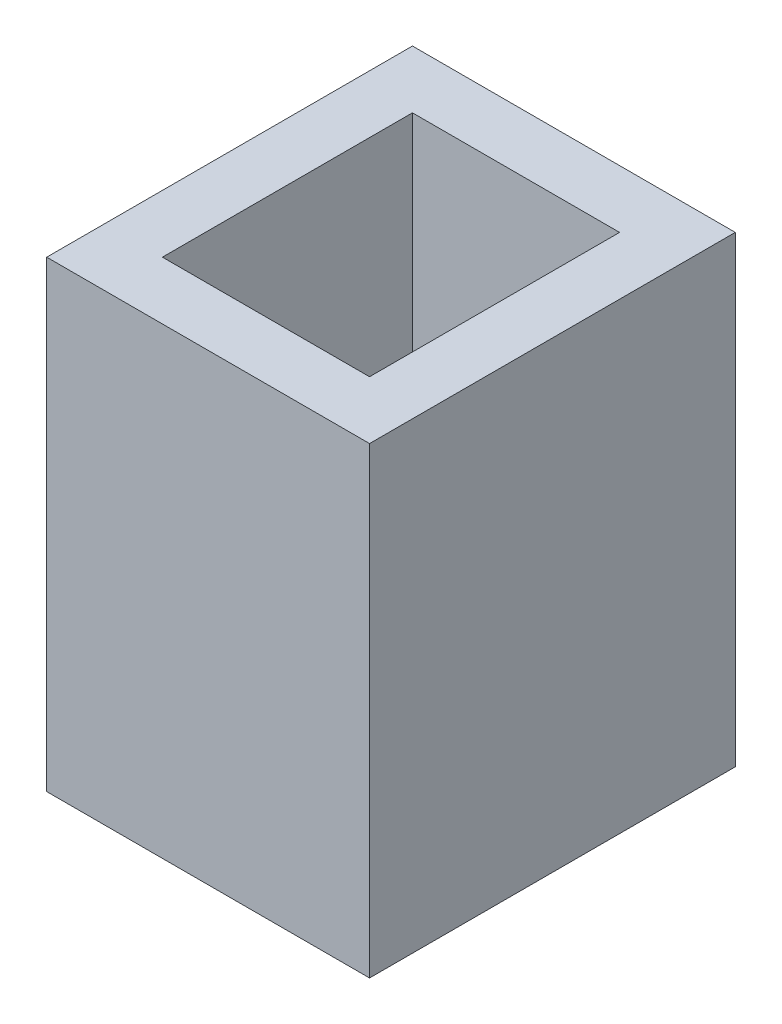
ISO-10303-21;
HEADER;
FILE_DESCRIPTION(('STEP AP214'),'2;1');
FILE_NAME('part.step','',(''),(''),'','','');
FILE_SCHEMA(('AUTOMOTIVE_DESIGN { 1 0 10303 214 1 1 1 1 }'));
ENDSEC;
DATA;
#1=APPLICATION_CONTEXT('core data for automotive mechanical design processes');
#2=APPLICATION_PROTOCOL_DEFINITION('international standard','automotive_design',2000,#1);
#3=PRODUCT_CONTEXT('',#1,'mechanical');
#4=PRODUCT('Part','Part','',(#3));
#5=PRODUCT_RELATED_PRODUCT_CATEGORY('part','',(#4));
#6=PRODUCT_DEFINITION_FORMATION('','',#4);
#7=PRODUCT_DEFINITION_CONTEXT('part definition',#1,'design');
#8=PRODUCT_DEFINITION('design','',#6,#7);
#9=PRODUCT_DEFINITION_SHAPE('','',#8);
#10=(LENGTH_UNIT() NAMED_UNIT(*) SI_UNIT(.MILLI.,.METRE.));
#11=(NAMED_UNIT(*) PLANE_ANGLE_UNIT() SI_UNIT($,.RADIAN.));
#12=(NAMED_UNIT(*) SI_UNIT($,.STERADIAN.) SOLID_ANGLE_UNIT());
#13=UNCERTAINTY_MEASURE_WITH_UNIT(LENGTH_MEASURE(1.E-05),#10,'distance_accuracy_value','');
#14=(GEOMETRIC_REPRESENTATION_CONTEXT(3) GLOBAL_UNCERTAINTY_ASSIGNED_CONTEXT((#13)) GLOBAL_UNIT_ASSIGNED_CONTEXT((#10,
#11,#12)) REPRESENTATION_CONTEXT('',''));
#15=CARTESIAN_POINT('',(0.,0.,0.));
#16=DIRECTION('',(0.,0.,1.));
#17=DIRECTION('',(1.,0.,0.));
#18=AXIS2_PLACEMENT_3D('',#15,#16,#17);
#19=CARTESIAN_POINT('',(0.,25.4,0.));
#20=DIRECTION('',(0.,-1.,0.));
#21=DIRECTION('',(0.,0.,-1.));
#22=AXIS2_PLACEMENT_3D('',#19,#20,#21);
#23=PLANE('',#22);
#24=DIRECTION('',(0.,0.,-1.));
#25=VECTOR('',#24,1.);
#26=CARTESIAN_POINT('',(8.85825,25.4,10.03554));
#27=LINE('',#26,#25);
#28=CARTESIAN_POINT('',(8.85825,25.4,10.03554));
#29=VERTEX_POINT('',#28);
#30=CARTESIAN_POINT('',(8.85825,25.4,-10.03554));
#31=VERTEX_POINT('',#30);
#32=EDGE_CURVE('E134',#29,#31,#27,.T.);
#33=ORIENTED_EDGE('',*,*,#32,.T.);
#34=DIRECTION('',(-1.,0.,0.));
#35=VECTOR('',#34,1.);
#36=CARTESIAN_POINT('',(-8.85825,25.4,-10.03554));
#37=LINE('',#36,#35);
#38=CARTESIAN_POINT('',(-8.85825,25.4,-10.03554));
#39=VERTEX_POINT('',#38);
#40=EDGE_CURVE('E137',#31,#39,#37,.T.);
#41=ORIENTED_EDGE('',*,*,#40,.T.);
#42=DIRECTION('',(0.,0.,1.));
#43=VECTOR('',#42,1.);
#44=CARTESIAN_POINT('',(-8.85824999999999,25.4,10.03554));
#45=LINE('',#44,#43);
#46=CARTESIAN_POINT('',(-8.85824999999999,25.4,10.03554));
#47=VERTEX_POINT('',#46);
#48=EDGE_CURVE('E140',#39,#47,#45,.T.);
#49=ORIENTED_EDGE('',*,*,#48,.T.);
#50=DIRECTION('',(1.,0.,0.));
#51=VECTOR('',#50,1.);
#52=CARTESIAN_POINT('',(-8.85824999999999,25.4,10.03554));
#53=LINE('',#52,#51);
#54=EDGE_CURVE('E142',#47,#29,#53,.T.);
#55=ORIENTED_EDGE('',*,*,#54,.T.);
#56=EDGE_LOOP('',(#33,#41,#49,#55));
#57=FACE_BOUND('',#56,.T.);
#58=DIRECTION('',(0.,0.,-1.));
#59=VECTOR('',#58,1.);
#60=CARTESIAN_POINT('',(5.68325,25.4,6.86054));
#61=LINE('',#60,#59);
#62=CARTESIAN_POINT('',(5.68325,25.4,6.86054));
#63=VERTEX_POINT('',#62);
#64=CARTESIAN_POINT('',(5.68325,25.4,-6.86054));
#65=VERTEX_POINT('',#64);
#66=EDGE_CURVE('E98',#63,#65,#61,.T.);
#67=ORIENTED_EDGE('',*,*,#66,.F.);
#68=DIRECTION('',(1.,0.,0.));
#69=VECTOR('',#68,1.);
#70=CARTESIAN_POINT('',(-5.68325,25.4,6.86054));
#71=LINE('',#70,#69);
#72=CARTESIAN_POINT('',(-5.68325,25.4,6.86054));
#73=VERTEX_POINT('',#72);
#74=EDGE_CURVE('E120',#73,#63,#71,.T.);
#75=ORIENTED_EDGE('',*,*,#74,.F.);
#76=DIRECTION('',(0.,0.,1.));
#77=VECTOR('',#76,1.);
#78=CARTESIAN_POINT('',(-5.68325,25.4,6.86054));
#79=LINE('',#78,#77);
#80=CARTESIAN_POINT('',(-5.68325,25.4,-6.86054));
#81=VERTEX_POINT('',#80);
#82=EDGE_CURVE('E118',#81,#73,#79,.T.);
#83=ORIENTED_EDGE('',*,*,#82,.F.);
#84=DIRECTION('',(-1.,0.,0.));
#85=VECTOR('',#84,1.);
#86=CARTESIAN_POINT('',(-5.68325,25.4,-6.86054));
#87=LINE('',#86,#85);
#88=EDGE_CURVE('E106',#65,#81,#87,.T.);
#89=ORIENTED_EDGE('',*,*,#88,.F.);
#90=EDGE_LOOP('',(#67,#75,#83,#89));
#91=FACE_BOUND('',#90,.T.);
#92=ADVANCED_FACE('F33',(#57,#91),#23,.F.);
#93=CARTESIAN_POINT('',(0.,0.,0.));
#94=DIRECTION('',(0.,-1.,0.));
#95=DIRECTION('',(0.,0.,-1.));
#96=AXIS2_PLACEMENT_3D('',#93,#94,#95);
#97=PLANE('',#96);
#98=DIRECTION('',(0.,0.,-1.));
#99=VECTOR('',#98,1.);
#100=CARTESIAN_POINT('',(8.85825,0.,10.03554));
#101=LINE('',#100,#99);
#102=CARTESIAN_POINT('',(8.85825,0.,10.03554));
#103=VERTEX_POINT('',#102);
#104=CARTESIAN_POINT('',(8.85825,0.,-10.03554));
#105=VERTEX_POINT('',#104);
#106=EDGE_CURVE('E114',#103,#105,#101,.T.);
#107=ORIENTED_EDGE('',*,*,#106,.F.);
#108=DIRECTION('',(1.,0.,0.));
#109=VECTOR('',#108,1.);
#110=CARTESIAN_POINT('',(-8.85824999999999,0.,10.03554));
#111=LINE('',#110,#109);
#112=CARTESIAN_POINT('',(-8.85824999999999,0.,10.03554));
#113=VERTEX_POINT('',#112);
#114=EDGE_CURVE('E138',#113,#103,#111,.T.);
#115=ORIENTED_EDGE('',*,*,#114,.F.);
#116=DIRECTION('',(0.,0.,1.));
#117=VECTOR('',#116,1.);
#118=CARTESIAN_POINT('',(-8.85824999999999,0.,10.03554));
#119=LINE('',#118,#117);
#120=CARTESIAN_POINT('',(-8.85825,0.,-10.03554));
#121=VERTEX_POINT('',#120);
#122=EDGE_CURVE('E149',#121,#113,#119,.T.);
#123=ORIENTED_EDGE('',*,*,#122,.F.);
#124=DIRECTION('',(-1.,0.,0.));
#125=VECTOR('',#124,1.);
#126=CARTESIAN_POINT('',(-8.85825,0.,-10.03554));
#127=LINE('',#126,#125);
#128=EDGE_CURVE('E147',#105,#121,#127,.T.);
#129=ORIENTED_EDGE('',*,*,#128,.F.);
#130=EDGE_LOOP('',(#107,#115,#123,#129));
#131=FACE_BOUND('',#130,.T.);
#132=DIRECTION('',(1.,0.,0.));
#133=VECTOR('',#132,1.);
#134=CARTESIAN_POINT('',(-5.68325,0.,6.86054));
#135=LINE('',#134,#133);
#136=CARTESIAN_POINT('',(-5.68325,0.,6.86054));
#137=VERTEX_POINT('',#136);
#138=CARTESIAN_POINT('',(5.68325,0.,6.86054));
#139=VERTEX_POINT('',#138);
#140=EDGE_CURVE('E107',#137,#139,#135,.T.);
#141=ORIENTED_EDGE('',*,*,#140,.T.);
#142=DIRECTION('',(0.,0.,-1.));
#143=VECTOR('',#142,1.);
#144=CARTESIAN_POINT('',(5.68325,0.,6.86054));
#145=LINE('',#144,#143);
#146=CARTESIAN_POINT('',(5.68325,0.,-6.86054));
#147=VERTEX_POINT('',#146);
#148=EDGE_CURVE('E56',#139,#147,#145,.T.);
#149=ORIENTED_EDGE('',*,*,#148,.T.);
#150=DIRECTION('',(-1.,0.,0.));
#151=VECTOR('',#150,1.);
#152=CARTESIAN_POINT('',(-5.68325,0.,-6.86054));
#153=LINE('',#152,#151);
#154=CARTESIAN_POINT('',(-5.68325,0.,-6.86054));
#155=VERTEX_POINT('',#154);
#156=EDGE_CURVE('E113',#147,#155,#153,.T.);
#157=ORIENTED_EDGE('',*,*,#156,.T.);
#158=DIRECTION('',(0.,0.,1.));
#159=VECTOR('',#158,1.);
#160=CARTESIAN_POINT('',(-5.68325,0.,6.86054));
#161=LINE('',#160,#159);
#162=EDGE_CURVE('E126',#155,#137,#161,.T.);
#163=ORIENTED_EDGE('',*,*,#162,.T.);
#164=EDGE_LOOP('',(#141,#149,#157,#163));
#165=FACE_BOUND('',#164,.T.);
#166=ADVANCED_FACE('F167',(#131,#165),#97,.T.);
#167=CARTESIAN_POINT('',(8.85825,25.4,10.03554));
#168=DIRECTION('',(-1.,0.,0.));
#169=DIRECTION('',(0.,0.,1.));
#170=AXIS2_PLACEMENT_3D('',#167,#168,#169);
#171=PLANE('',#170);
#172=ORIENTED_EDGE('',*,*,#106,.T.);
#173=DIRECTION('',(0.,-1.,0.));
#174=VECTOR('',#173,1.);
#175=CARTESIAN_POINT('',(8.85825,25.4,-10.03554));
#176=LINE('',#175,#174);
#177=EDGE_CURVE('E11',#31,#105,#176,.T.);
#178=ORIENTED_EDGE('',*,*,#177,.F.);
#179=ORIENTED_EDGE('',*,*,#32,.F.);
#180=DIRECTION('',(0.,-1.,0.));
#181=VECTOR('',#180,1.);
#182=CARTESIAN_POINT('',(8.85825,25.4,10.03554));
#183=LINE('',#182,#181);
#184=EDGE_CURVE('E144',#29,#103,#183,.T.);
#185=ORIENTED_EDGE('',*,*,#184,.T.);
#186=EDGE_LOOP('',(#172,#178,#179,#185));
#187=FACE_BOUND('',#186,.T.);
#188=ADVANCED_FACE('F35',(#187),#171,.F.);
#189=CARTESIAN_POINT('',(-8.85825,25.4,-10.03554));
#190=DIRECTION('',(0.,0.,1.));
#191=DIRECTION('',(1.,0.,0.));
#192=AXIS2_PLACEMENT_3D('',#189,#190,#191);
#193=PLANE('',#192);
#194=ORIENTED_EDGE('',*,*,#128,.T.);
#195=DIRECTION('',(0.,-1.,0.));
#196=VECTOR('',#195,1.);
#197=CARTESIAN_POINT('',(-8.85825,25.4,-10.03554));
#198=LINE('',#197,#196);
#199=EDGE_CURVE('E41',#39,#121,#198,.T.);
#200=ORIENTED_EDGE('',*,*,#199,.F.);
#201=ORIENTED_EDGE('',*,*,#40,.F.);
#202=ORIENTED_EDGE('',*,*,#177,.T.);
#203=EDGE_LOOP('',(#194,#200,#201,#202));
#204=FACE_BOUND('',#203,.T.);
#205=ADVANCED_FACE('F177',(#204),#193,.F.);
#206=CARTESIAN_POINT('',(-8.85824999999999,25.4,10.03554));
#207=DIRECTION('',(1.,0.,0.));
#208=DIRECTION('',(0.,0.,-1.));
#209=AXIS2_PLACEMENT_3D('',#206,#207,#208);
#210=PLANE('',#209);
#211=ORIENTED_EDGE('',*,*,#122,.T.);
#212=DIRECTION('',(0.,-1.,0.));
#213=VECTOR('',#212,1.);
#214=CARTESIAN_POINT('',(-8.85824999999999,25.4,10.03554));
#215=LINE('',#214,#213);
#216=EDGE_CURVE('E154',#47,#113,#215,.T.);
#217=ORIENTED_EDGE('',*,*,#216,.F.);
#218=ORIENTED_EDGE('',*,*,#48,.F.);
#219=ORIENTED_EDGE('',*,*,#199,.T.);
#220=EDGE_LOOP('',(#211,#217,#218,#219));
#221=FACE_BOUND('',#220,.T.);
#222=ADVANCED_FACE('F161',(#221),#210,.F.);
#223=CARTESIAN_POINT('',(-8.85824999999999,25.4,10.03554));
#224=DIRECTION('',(0.,0.,-1.));
#225=DIRECTION('',(-1.,0.,0.));
#226=AXIS2_PLACEMENT_3D('',#223,#224,#225);
#227=PLANE('',#226);
#228=ORIENTED_EDGE('',*,*,#114,.T.);
#229=ORIENTED_EDGE('',*,*,#184,.F.);
#230=ORIENTED_EDGE('',*,*,#54,.F.);
#231=ORIENTED_EDGE('',*,*,#216,.T.);
#232=EDGE_LOOP('',(#228,#229,#230,#231));
#233=FACE_BOUND('',#232,.T.);
#234=ADVANCED_FACE('F171',(#233),#227,.F.);
#235=CARTESIAN_POINT('',(5.68325,25.4,6.86054));
#236=DIRECTION('',(-1.,0.,0.));
#237=DIRECTION('',(0.,0.,1.));
#238=AXIS2_PLACEMENT_3D('',#235,#236,#237);
#239=PLANE('',#238);
#240=ORIENTED_EDGE('',*,*,#148,.F.);
#241=DIRECTION('',(0.,-1.,0.));
#242=VECTOR('',#241,1.);
#243=CARTESIAN_POINT('',(5.68325,25.4,6.86054));
#244=LINE('',#243,#242);
#245=EDGE_CURVE('E102',#63,#139,#244,.T.);
#246=ORIENTED_EDGE('',*,*,#245,.F.);
#247=ORIENTED_EDGE('',*,*,#66,.T.);
#248=DIRECTION('',(0.,-1.,0.));
#249=VECTOR('',#248,1.);
#250=CARTESIAN_POINT('',(5.68325,25.4,-6.86054));
#251=LINE('',#250,#249);
#252=EDGE_CURVE('E101',#65,#147,#251,.T.);
#253=ORIENTED_EDGE('',*,*,#252,.T.);
#254=EDGE_LOOP('',(#240,#246,#247,#253));
#255=FACE_BOUND('',#254,.T.);
#256=ADVANCED_FACE('F100',(#255),#239,.T.);
#257=CARTESIAN_POINT('',(-5.68325,25.4,-6.86054));
#258=DIRECTION('',(0.,0.,1.));
#259=DIRECTION('',(1.,0.,0.));
#260=AXIS2_PLACEMENT_3D('',#257,#258,#259);
#261=PLANE('',#260);
#262=ORIENTED_EDGE('',*,*,#156,.F.);
#263=ORIENTED_EDGE('',*,*,#252,.F.);
#264=ORIENTED_EDGE('',*,*,#88,.T.);
#265=DIRECTION('',(0.,-1.,0.));
#266=VECTOR('',#265,1.);
#267=CARTESIAN_POINT('',(-5.68325,25.4,-6.86054));
#268=LINE('',#267,#266);
#269=EDGE_CURVE('E115',#81,#155,#268,.T.);
#270=ORIENTED_EDGE('',*,*,#269,.T.);
#271=EDGE_LOOP('',(#262,#263,#264,#270));
#272=FACE_BOUND('',#271,.T.);
#273=ADVANCED_FACE('F110',(#272),#261,.T.);
#274=CARTESIAN_POINT('',(-5.68325,25.4,6.86054));
#275=DIRECTION('',(1.,0.,0.));
#276=DIRECTION('',(0.,0.,-1.));
#277=AXIS2_PLACEMENT_3D('',#274,#275,#276);
#278=PLANE('',#277);
#279=ORIENTED_EDGE('',*,*,#162,.F.);
#280=ORIENTED_EDGE('',*,*,#269,.F.);
#281=ORIENTED_EDGE('',*,*,#82,.T.);
#282=DIRECTION('',(0.,-1.,0.));
#283=VECTOR('',#282,1.);
#284=CARTESIAN_POINT('',(-5.68325,25.4,6.86054));
#285=LINE('',#284,#283);
#286=EDGE_CURVE('E48',#73,#137,#285,.T.);
#287=ORIENTED_EDGE('',*,*,#286,.T.);
#288=EDGE_LOOP('',(#279,#280,#281,#287));
#289=FACE_BOUND('',#288,.T.);
#290=ADVANCED_FACE('F200',(#289),#278,.T.);
#291=CARTESIAN_POINT('',(-5.68325,25.4,6.86054));
#292=DIRECTION('',(0.,0.,-1.));
#293=DIRECTION('',(-1.,0.,0.));
#294=AXIS2_PLACEMENT_3D('',#291,#292,#293);
#295=PLANE('',#294);
#296=ORIENTED_EDGE('',*,*,#140,.F.);
#297=ORIENTED_EDGE('',*,*,#286,.F.);
#298=ORIENTED_EDGE('',*,*,#74,.T.);
#299=ORIENTED_EDGE('',*,*,#245,.T.);
#300=EDGE_LOOP('',(#296,#297,#298,#299));
#301=FACE_BOUND('',#300,.T.);
#302=ADVANCED_FACE('F204',(#301),#295,.T.);
#303=CLOSED_SHELL('',(#92,#166,#188,#205,#222,#234,#256,#273,#290,#302));
#304=MANIFOLD_SOLID_BREP('B2',#303);
#305=ADVANCED_BREP_SHAPE_REPRESENTATION('',(#18,#304),#14);
#306=SHAPE_DEFINITION_REPRESENTATION(#9,#305);
ENDSEC;
END-ISO-10303-21;
